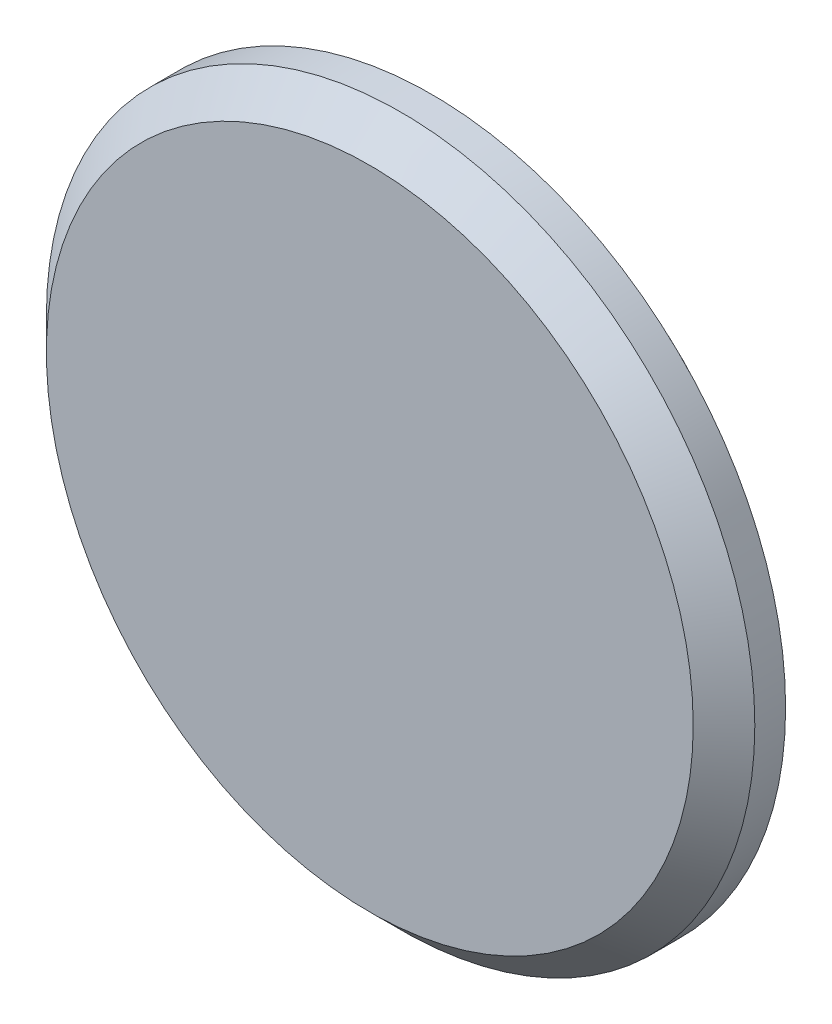
ISO-10303-21;
HEADER;
FILE_DESCRIPTION(('STEP AP214'),'2;1');
FILE_NAME('part.step','',(''),(''),'','','');
FILE_SCHEMA(('AUTOMOTIVE_DESIGN { 1 0 10303 214 1 1 1 1 }'));
ENDSEC;
DATA;
#1=APPLICATION_CONTEXT('core data for automotive mechanical design processes');
#2=APPLICATION_PROTOCOL_DEFINITION('international standard','automotive_design',2000,#1);
#3=PRODUCT_CONTEXT('',#1,'mechanical');
#4=PRODUCT('Part','Part','',(#3));
#5=PRODUCT_RELATED_PRODUCT_CATEGORY('part','',(#4));
#6=PRODUCT_DEFINITION_FORMATION('','',#4);
#7=PRODUCT_DEFINITION_CONTEXT('part definition',#1,'design');
#8=PRODUCT_DEFINITION('design','',#6,#7);
#9=PRODUCT_DEFINITION_SHAPE('','',#8);
#10=(LENGTH_UNIT() NAMED_UNIT(*) SI_UNIT(.MILLI.,.METRE.));
#11=(NAMED_UNIT(*) PLANE_ANGLE_UNIT() SI_UNIT($,.RADIAN.));
#12=(NAMED_UNIT(*) SI_UNIT($,.STERADIAN.) SOLID_ANGLE_UNIT());
#13=UNCERTAINTY_MEASURE_WITH_UNIT(LENGTH_MEASURE(1.E-05),#10,'distance_accuracy_value','');
#14=(GEOMETRIC_REPRESENTATION_CONTEXT(3) GLOBAL_UNCERTAINTY_ASSIGNED_CONTEXT((#13)) GLOBAL_UNIT_ASSIGNED_CONTEXT((#10,
#11,#12)) REPRESENTATION_CONTEXT('',''));
#15=CARTESIAN_POINT('',(0.,0.,0.));
#16=DIRECTION('',(0.,0.,1.));
#17=DIRECTION('',(1.,0.,0.));
#18=AXIS2_PLACEMENT_3D('',#15,#16,#17);
#19=CARTESIAN_POINT('',(-1.0547118733939E-12,3.88578058618805E-13,-6.35000000000052));
#20=DIRECTION('',(0.,0.,1.));
#21=DIRECTION('',(1.,0.,0.));
#22=AXIS2_PLACEMENT_3D('',#19,#20,#21);
#23=CYLINDRICAL_SURFACE('',#22,30.0863);
#24=CARTESIAN_POINT('',(-9.99200722162641E-13,2.22044604925031E-13,-3.81000000000054));
#25=DIRECTION('',(0.,0.,1.));
#26=DIRECTION('',(1.,0.,0.));
#27=AXIS2_PLACEMENT_3D('',#24,#25,#26);
#28=CIRCLE('',#27,30.0863);
#29=CARTESIAN_POINT('',(30.086299999999,2.22044604925031E-13,-3.81000000000054));
#30=VERTEX_POINT('',#29);
#31=EDGE_CURVE('E40',#30,#30,#28,.T.);
#32=ORIENTED_EDGE('',*,*,#31,.T.);
#33=EDGE_LOOP('',(#32));
#34=FACE_BOUND('',#33,.T.);
#35=CARTESIAN_POINT('',(0.,0.,0.));
#36=DIRECTION('',(0.,0.,1.));
#37=DIRECTION('',(1.,0.,0.));
#38=AXIS2_PLACEMENT_3D('',#35,#36,#37);
#39=CIRCLE('',#38,30.0863);
#40=CARTESIAN_POINT('',(30.0863,0.,0.));
#41=VERTEX_POINT('',#40);
#42=EDGE_CURVE('E53',#41,#41,#39,.T.);
#43=ORIENTED_EDGE('',*,*,#42,.F.);
#44=EDGE_LOOP('',(#43));
#45=FACE_BOUND('',#44,.T.);
#46=ADVANCED_FACE('F33',(#34,#45),#23,.T.);
#47=CARTESIAN_POINT('',(-1.0547118733939E-12,3.88578058618805E-13,-6.35000000000052));
#48=DIRECTION('',(0.,0.,1.));
#49=DIRECTION('',(1.,0.,0.));
#50=AXIS2_PLACEMENT_3D('',#47,#48,#49);
#51=PLANE('',#50);
#52=CARTESIAN_POINT('',(-1.0547118733939E-12,3.88578058618805E-13,-6.35000000000052));
#53=DIRECTION('',(0.,0.,1.));
#54=DIRECTION('',(1.,0.,0.));
#55=AXIS2_PLACEMENT_3D('',#52,#53,#54);
#56=CIRCLE('',#55,27.5463);
#57=CARTESIAN_POINT('',(27.5462999999989,3.88578058618805E-13,-6.35000000000052));
#58=VERTEX_POINT('',#57);
#59=EDGE_CURVE('E10',#58,#58,#56,.F.);
#60=ORIENTED_EDGE('',*,*,#59,.T.);
#61=EDGE_LOOP('',(#60));
#62=FACE_BOUND('',#61,.T.);
#63=ADVANCED_FACE('F77',(#62),#51,.F.);
#64=CARTESIAN_POINT('',(0.,2.22044604925031E-13,6.34999999999875));
#65=DIRECTION('',(0.,0.,-1.));
#66=DIRECTION('',(-1.,0.,0.));
#67=AXIS2_PLACEMENT_3D('',#64,#65,#66);
#68=CYLINDRICAL_SURFACE('',#67,36.5125);
#69=CARTESIAN_POINT('',(0.,9.43689570931383E-13,3.17499999999948));
#70=DIRECTION('',(0.,0.,1.));
#71=DIRECTION('',(1.,0.,0.));
#72=AXIS2_PLACEMENT_3D('',#69,#70,#71);
#73=CIRCLE('',#72,36.5125);
#74=CARTESIAN_POINT('',(36.5125,9.43689570931383E-13,3.17499999999948));
#75=VERTEX_POINT('',#74);
#76=EDGE_CURVE('E44',#75,#75,#73,.F.);
#77=ORIENTED_EDGE('',*,*,#76,.T.);
#78=EDGE_LOOP('',(#77));
#79=FACE_BOUND('',#78,.T.);
#80=CARTESIAN_POINT('',(0.,0.,0.));
#81=DIRECTION('',(0.,0.,1.));
#82=DIRECTION('',(1.,0.,0.));
#83=AXIS2_PLACEMENT_3D('',#80,#81,#82);
#84=CIRCLE('',#83,36.5125);
#85=CARTESIAN_POINT('',(36.5125,0.,0.));
#86=VERTEX_POINT('',#85);
#87=EDGE_CURVE('E56',#86,#86,#84,.T.);
#88=ORIENTED_EDGE('',*,*,#87,.T.);
#89=EDGE_LOOP('',(#88));
#90=FACE_BOUND('',#89,.T.);
#91=ADVANCED_FACE('F60',(#79,#90),#68,.T.);
#92=CARTESIAN_POINT('',(0.,2.22044604925031E-13,6.34999999999875));
#93=DIRECTION('',(0.,0.,1.));
#94=DIRECTION('',(1.,0.,0.));
#95=AXIS2_PLACEMENT_3D('',#92,#93,#94);
#96=PLANE('',#95);
#97=CARTESIAN_POINT('',(0.,2.22044604925031E-13,6.34999999999875));
#98=DIRECTION('',(0.,0.,1.));
#99=DIRECTION('',(1.,0.,0.));
#100=AXIS2_PLACEMENT_3D('',#97,#98,#99);
#101=CIRCLE('',#100,33.3375);
#102=CARTESIAN_POINT('',(33.3375,2.22044604925031E-13,6.34999999999875));
#103=VERTEX_POINT('',#102);
#104=EDGE_CURVE('E48',#103,#103,#101,.T.);
#105=ORIENTED_EDGE('',*,*,#104,.T.);
#106=EDGE_LOOP('',(#105));
#107=FACE_BOUND('',#106,.T.);
#108=ADVANCED_FACE('F65',(#107),#96,.T.);
#109=CARTESIAN_POINT('',(0.,0.,0.));
#110=DIRECTION('',(0.,0.,1.));
#111=DIRECTION('',(1.,0.,0.));
#112=AXIS2_PLACEMENT_3D('',#109,#110,#111);
#113=PLANE('',#112);
#114=ORIENTED_EDGE('',*,*,#42,.T.);
#115=EDGE_LOOP('',(#114));
#116=FACE_BOUND('',#115,.T.);
#117=ORIENTED_EDGE('',*,*,#87,.F.);
#118=EDGE_LOOP('',(#117));
#119=FACE_BOUND('',#118,.T.);
#120=ADVANCED_FACE('F62',(#116,#119),#113,.F.);
#121=CARTESIAN_POINT('',(0.,2.22044604925031E-13,6.34999999999875));
#122=DIRECTION('',(0.,0.,-1.));
#123=DIRECTION('',(-1.,0.,0.));
#124=AXIS2_PLACEMENT_3D('',#121,#122,#123);
#125=CONICAL_SURFACE('',#124,33.3375,0.785398163397448);
#126=ORIENTED_EDGE('',*,*,#76,.F.);
#127=EDGE_LOOP('',(#126));
#128=FACE_BOUND('',#127,.T.);
#129=ORIENTED_EDGE('',*,*,#104,.F.);
#130=EDGE_LOOP('',(#129));
#131=FACE_BOUND('',#130,.T.);
#132=ADVANCED_FACE('F64',(#128,#131),#125,.T.);
#133=CARTESIAN_POINT('',(-9.99200722162641E-13,2.22044604925031E-13,-3.81000000000054));
#134=DIRECTION('',(0.,0.,1.));
#135=DIRECTION('',(1.,0.,0.));
#136=AXIS2_PLACEMENT_3D('',#133,#134,#135);
#137=CONICAL_SURFACE('',#136,30.0863,0.785398163397447);
#138=ORIENTED_EDGE('',*,*,#59,.F.);
#139=EDGE_LOOP('',(#138));
#140=FACE_BOUND('',#139,.T.);
#141=ORIENTED_EDGE('',*,*,#31,.F.);
#142=EDGE_LOOP('',(#141));
#143=FACE_BOUND('',#142,.T.);
#144=ADVANCED_FACE('F35',(#140,#143),#137,.T.);
#145=CLOSED_SHELL('',(#46,#63,#91,#108,#120,#132,#144));
#146=MANIFOLD_SOLID_BREP('B2',#145);
#147=ADVANCED_BREP_SHAPE_REPRESENTATION('',(#18,#146),#14);
#148=SHAPE_DEFINITION_REPRESENTATION(#9,#147);
ENDSEC;
END-ISO-10303-21;
